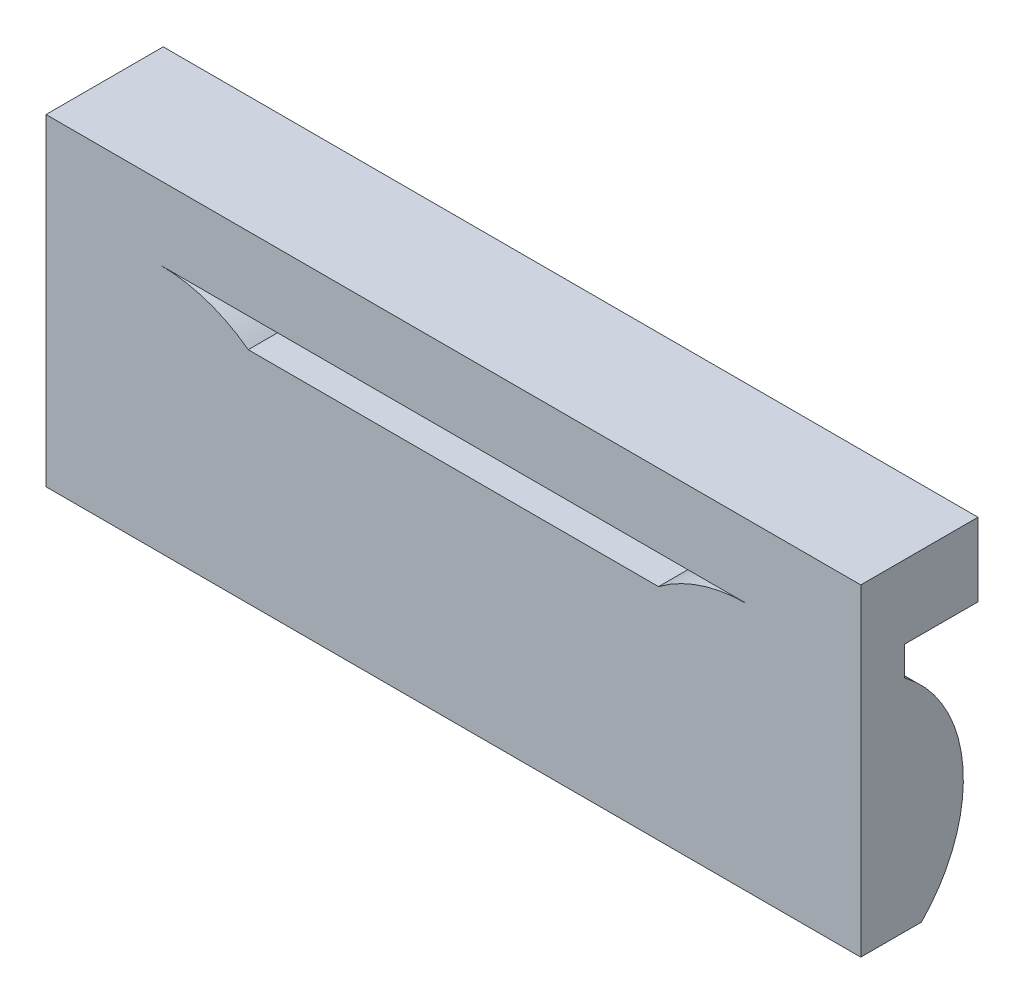
ISO-10303-21;
HEADER;
FILE_DESCRIPTION(('STEP AP214'),'2;1');
FILE_NAME('part.step','',(''),(''),'','','');
FILE_SCHEMA(('AUTOMOTIVE_DESIGN { 1 0 10303 214 1 1 1 1 }'));
ENDSEC;
DATA;
#1=APPLICATION_CONTEXT('core data for automotive mechanical design processes');
#2=APPLICATION_PROTOCOL_DEFINITION('international standard','automotive_design',2000,#1);
#3=PRODUCT_CONTEXT('',#1,'mechanical');
#4=PRODUCT('Part','Part','',(#3));
#5=PRODUCT_RELATED_PRODUCT_CATEGORY('part','',(#4));
#6=PRODUCT_DEFINITION_FORMATION('','',#4);
#7=PRODUCT_DEFINITION_CONTEXT('part definition',#1,'design');
#8=PRODUCT_DEFINITION('design','',#6,#7);
#9=PRODUCT_DEFINITION_SHAPE('','',#8);
#10=(LENGTH_UNIT() NAMED_UNIT(*) SI_UNIT(.MILLI.,.METRE.));
#11=(NAMED_UNIT(*) PLANE_ANGLE_UNIT() SI_UNIT($,.RADIAN.));
#12=(NAMED_UNIT(*) SI_UNIT($,.STERADIAN.) SOLID_ANGLE_UNIT());
#13=UNCERTAINTY_MEASURE_WITH_UNIT(LENGTH_MEASURE(1.E-05),#10,'distance_accuracy_value','');
#14=(GEOMETRIC_REPRESENTATION_CONTEXT(3) GLOBAL_UNCERTAINTY_ASSIGNED_CONTEXT((#13)) GLOBAL_UNIT_ASSIGNED_CONTEXT((#10,
#11,#12)) REPRESENTATION_CONTEXT('',''));
#15=CARTESIAN_POINT('',(0.,0.,0.));
#16=DIRECTION('',(0.,0.,1.));
#17=DIRECTION('',(1.,0.,0.));
#18=AXIS2_PLACEMENT_3D('',#15,#16,#17);
#19=CARTESIAN_POINT('',(6.5,0.,-1.625));
#20=DIRECTION('',(-1.,0.,0.));
#21=DIRECTION('',(0.,0.,1.));
#22=AXIS2_PLACEMENT_3D('',#19,#20,#21);
#23=PLANE('',#22);
#24=CARTESIAN_POINT('',(6.5,-0.999999999999999,1.125));
#25=DIRECTION('',(-1.,0.,0.));
#26=DIRECTION('',(0.,0.,1.));
#27=AXIS2_PLACEMENT_3D('',#24,#25,#26);
#28=CIRCLE('',#27,2.5);
#29=CARTESIAN_POINT('',(6.5,-2.25,-1.0400635094611));
#30=VERTEX_POINT('',#29);
#31=CARTESIAN_POINT('',(6.5,1.,-0.375));
#32=VERTEX_POINT('',#31);
#33=EDGE_CURVE('E191',#30,#32,#28,.F.);
#34=ORIENTED_EDGE('',*,*,#33,.F.);
#35=DIRECTION('',(0.,0.,1.));
#36=VECTOR('',#35,1.);
#37=CARTESIAN_POINT('',(6.5,-2.25,-1.625));
#38=LINE('',#37,#36);
#39=CARTESIAN_POINT('',(6.5,-2.25,-0.375));
#40=VERTEX_POINT('',#39);
#41=EDGE_CURVE('E341',#30,#40,#38,.T.);
#42=ORIENTED_EDGE('',*,*,#41,.T.);
#43=DIRECTION('',(0.,-1.,0.));
#44=VECTOR('',#43,1.);
#45=CARTESIAN_POINT('',(6.5,0.,-0.375));
#46=LINE('',#45,#44);
#47=EDGE_CURVE('E317',#32,#40,#46,.T.);
#48=ORIENTED_EDGE('',*,*,#47,.F.);
#49=EDGE_LOOP('',(#34,#42,#48));
#50=FACE_BOUND('',#49,.T.);
#51=ADVANCED_FACE('F43',(#50),#23,.T.);
#52=CARTESIAN_POINT('',(-6.5,0.,-1.625));
#53=DIRECTION('',(1.,0.,0.));
#54=DIRECTION('',(0.,1.,0.));
#55=AXIS2_PLACEMENT_3D('',#52,#53,#54);
#56=PLANE('',#55);
#57=CARTESIAN_POINT('',(-6.5,-0.999999999999999,1.125));
#58=DIRECTION('',(1.,0.,0.));
#59=DIRECTION('',(0.,1.,0.));
#60=AXIS2_PLACEMENT_3D('',#57,#58,#59);
#61=CIRCLE('',#60,2.5);
#62=CARTESIAN_POINT('',(-6.5,1.,-0.375));
#63=VERTEX_POINT('',#62);
#64=CARTESIAN_POINT('',(-6.5,-2.25,-1.0400635094611));
#65=VERTEX_POINT('',#64);
#66=EDGE_CURVE('E248',#63,#65,#61,.F.);
#67=ORIENTED_EDGE('',*,*,#66,.F.);
#68=DIRECTION('',(0.,1.,0.));
#69=VECTOR('',#68,1.);
#70=CARTESIAN_POINT('',(-6.5,0.,-0.375));
#71=LINE('',#70,#69);
#72=CARTESIAN_POINT('',(-6.5,-2.25,-0.375));
#73=VERTEX_POINT('',#72);
#74=EDGE_CURVE('E350',#73,#63,#71,.T.);
#75=ORIENTED_EDGE('',*,*,#74,.F.);
#76=DIRECTION('',(0.,0.,1.));
#77=VECTOR('',#76,1.);
#78=CARTESIAN_POINT('',(-6.5,-2.25,-1.625));
#79=LINE('',#78,#77);
#80=EDGE_CURVE('E67',#65,#73,#79,.T.);
#81=ORIENTED_EDGE('',*,*,#80,.F.);
#82=EDGE_LOOP('',(#67,#75,#81));
#83=FACE_BOUND('',#82,.T.);
#84=ADVANCED_FACE('F451',(#83),#56,.T.);
#85=CARTESIAN_POINT('',(0.,0.,-1.625));
#86=DIRECTION('',(0.,0.,-1.));
#87=DIRECTION('',(-1.,0.,0.));
#88=AXIS2_PLACEMENT_3D('',#85,#86,#87);
#89=PLANE('',#88);
#90=DIRECTION('',(0.,-1.,0.));
#91=VECTOR('',#90,1.);
#92=CARTESIAN_POINT('',(6.95,0.,-1.625));
#93=LINE('',#92,#91);
#94=CARTESIAN_POINT('',(6.95,2.75,-1.625));
#95=VERTEX_POINT('',#94);
#96=CARTESIAN_POINT('',(6.95,1.5,-1.625));
#97=VERTEX_POINT('',#96);
#98=EDGE_CURVE('E334',#95,#97,#93,.T.);
#99=ORIENTED_EDGE('',*,*,#98,.T.);
#100=DIRECTION('',(-1.,0.,0.));
#101=VECTOR('',#100,1.);
#102=CARTESIAN_POINT('',(0.,1.5,-1.625));
#103=LINE('',#102,#101);
#104=CARTESIAN_POINT('',(6.5,1.5,-1.625));
#105=VERTEX_POINT('',#104);
#106=EDGE_CURVE('E259',#97,#105,#103,.T.);
#107=ORIENTED_EDGE('',*,*,#106,.T.);
#108=DIRECTION('',(0.,-1.,0.));
#109=VECTOR('',#108,1.);
#110=CARTESIAN_POINT('',(6.5,0.,-1.625));
#111=LINE('',#110,#109);
#112=CARTESIAN_POINT('',(6.5,2.25,-1.625));
#113=VERTEX_POINT('',#112);
#114=EDGE_CURVE('E318',#113,#105,#111,.T.);
#115=ORIENTED_EDGE('',*,*,#114,.F.);
#116=DIRECTION('',(1.,0.,0.));
#117=VECTOR('',#116,1.);
#118=CARTESIAN_POINT('',(0.,2.25,-1.625));
#119=LINE('',#118,#117);
#120=CARTESIAN_POINT('',(-6.5,2.25,-1.625));
#121=VERTEX_POINT('',#120);
#122=EDGE_CURVE('E322',#121,#113,#119,.T.);
#123=ORIENTED_EDGE('',*,*,#122,.F.);
#124=DIRECTION('',(0.,1.,0.));
#125=VECTOR('',#124,1.);
#126=CARTESIAN_POINT('',(-6.5,0.,-1.625));
#127=LINE('',#126,#125);
#128=CARTESIAN_POINT('',(-6.5,1.5,-1.625));
#129=VERTEX_POINT('',#128);
#130=EDGE_CURVE('E327',#129,#121,#127,.T.);
#131=ORIENTED_EDGE('',*,*,#130,.F.);
#132=CARTESIAN_POINT('',(-6.95,1.5,-1.625));
#133=VERTEX_POINT('',#132);
#134=EDGE_CURVE('E254',#129,#133,#103,.T.);
#135=ORIENTED_EDGE('',*,*,#134,.T.);
#136=DIRECTION('',(0.,1.,0.));
#137=VECTOR('',#136,1.);
#138=CARTESIAN_POINT('',(-6.95,0.,-1.625));
#139=LINE('',#138,#137);
#140=CARTESIAN_POINT('',(-6.95,2.74999999999995,-1.625));
#141=VERTEX_POINT('',#140);
#142=EDGE_CURVE('E338',#133,#141,#139,.T.);
#143=ORIENTED_EDGE('',*,*,#142,.T.);
#144=DIRECTION('',(1.,0.,0.));
#145=VECTOR('',#144,1.);
#146=CARTESIAN_POINT('',(0.,2.74999999999997,-1.625));
#147=LINE('',#146,#145);
#148=EDGE_CURVE('E330',#141,#95,#147,.T.);
#149=ORIENTED_EDGE('',*,*,#148,.T.);
#150=EDGE_LOOP('',(#99,#107,#115,#123,#131,#135,#143,#149));
#151=FACE_BOUND('',#150,.T.);
#152=ADVANCED_FACE('F401',(#151),#89,.T.);
#153=CARTESIAN_POINT('',(0.,0.,0.375));
#154=DIRECTION('',(0.,0.,1.));
#155=DIRECTION('',(1.,0.,0.));
#156=AXIS2_PLACEMENT_3D('',#153,#154,#155);
#157=PLANE('',#156);
#158=DIRECTION('',(0.,1.,0.));
#159=VECTOR('',#158,1.);
#160=CARTESIAN_POINT('',(6.95,0.,0.375));
#161=LINE('',#160,#159);
#162=CARTESIAN_POINT('',(6.95,-2.75,0.375));
#163=VERTEX_POINT('',#162);
#164=CARTESIAN_POINT('',(6.95,2.75,0.375));
#165=VERTEX_POINT('',#164);
#166=EDGE_CURVE('E369',#163,#165,#161,.T.);
#167=ORIENTED_EDGE('',*,*,#166,.T.);
#168=DIRECTION('',(-1.,0.,0.));
#169=VECTOR('',#168,1.);
#170=CARTESIAN_POINT('',(0.,2.74999999999997,0.375));
#171=LINE('',#170,#169);
#172=CARTESIAN_POINT('',(-6.95,2.75,0.375));
#173=VERTEX_POINT('',#172);
#174=EDGE_CURVE('E373',#165,#173,#171,.T.);
#175=ORIENTED_EDGE('',*,*,#174,.T.);
#176=DIRECTION('',(0.,1.,0.));
#177=VECTOR('',#176,1.);
#178=CARTESIAN_POINT('',(-6.95,0.,0.375));
#179=LINE('',#178,#177);
#180=CARTESIAN_POINT('',(-6.95,-2.75,0.375));
#181=VERTEX_POINT('',#180);
#182=EDGE_CURVE('E376',#181,#173,#179,.T.);
#183=ORIENTED_EDGE('',*,*,#182,.F.);
#184=DIRECTION('',(1.,0.,0.));
#185=VECTOR('',#184,1.);
#186=CARTESIAN_POINT('',(0.,-2.75,0.375));
#187=LINE('',#186,#185);
#188=EDGE_CURVE('E380',#181,#163,#187,.T.);
#189=ORIENTED_EDGE('',*,*,#188,.T.);
#190=EDGE_LOOP('',(#167,#175,#183,#189));
#191=FACE_BOUND('',#190,.T.);
#192=DIRECTION('',(1.,0.,0.));
#193=VECTOR('',#192,1.);
#194=CARTESIAN_POINT('',(0.,1.50000000000001,0.375));
#195=LINE('',#194,#193);
#196=CARTESIAN_POINT('',(-5.,1.5,0.375));
#197=VERTEX_POINT('',#196);
#198=CARTESIAN_POINT('',(5.,1.50000000000002,0.375));
#199=VERTEX_POINT('',#198);
#200=EDGE_CURVE('E267',#197,#199,#195,.T.);
#201=ORIENTED_EDGE('',*,*,#200,.T.);
#202=CARTESIAN_POINT('',(5.00000000000001,-0.999999999999964,0.375));
#203=DIRECTION('',(0.,0.,-1.));
#204=DIRECTION('',(-1.,0.,0.));
#205=AXIS2_PLACEMENT_3D('',#202,#203,#204);
#206=CIRCLE('',#205,2.49999999999998);
#207=CARTESIAN_POINT('',(3.5,1.00000000000001,0.375));
#208=VERTEX_POINT('',#207);
#209=EDGE_CURVE('E271',#199,#208,#206,.F.);
#210=ORIENTED_EDGE('',*,*,#209,.T.);
#211=DIRECTION('',(-1.,0.,0.));
#212=VECTOR('',#211,1.);
#213=CARTESIAN_POINT('',(0.,1.00000000000001,0.375));
#214=LINE('',#213,#212);
#215=CARTESIAN_POINT('',(-3.5,1.,0.375));
#216=VERTEX_POINT('',#215);
#217=EDGE_CURVE('E59',#208,#216,#214,.T.);
#218=ORIENTED_EDGE('',*,*,#217,.T.);
#219=CARTESIAN_POINT('',(-5.,-0.999999999999999,0.375));
#220=DIRECTION('',(0.,0.,-1.));
#221=DIRECTION('',(-1.,0.,0.));
#222=AXIS2_PLACEMENT_3D('',#219,#220,#221);
#223=CIRCLE('',#222,2.5);
#224=EDGE_CURVE('E277',#216,#197,#223,.F.);
#225=ORIENTED_EDGE('',*,*,#224,.T.);
#226=EDGE_LOOP('',(#201,#210,#218,#225));
#227=FACE_BOUND('',#226,.T.);
#228=ADVANCED_FACE('F410',(#191,#227),#157,.T.);
#229=CARTESIAN_POINT('',(0.,-2.25,-1.625));
#230=DIRECTION('',(0.,1.,0.));
#231=DIRECTION('',(-1.,0.,0.));
#232=AXIS2_PLACEMENT_3D('',#229,#230,#231);
#233=PLANE('',#232);
#234=DIRECTION('',(1.,0.,0.));
#235=VECTOR('',#234,1.);
#236=CARTESIAN_POINT('',(-6.95,-2.25,-1.0400635094611));
#237=LINE('',#236,#235);
#238=CARTESIAN_POINT('',(-2.8349364905389,-2.25,-1.0400635094611));
#239=VERTEX_POINT('',#238);
#240=EDGE_CURVE('E245',#65,#239,#237,.T.);
#241=ORIENTED_EDGE('',*,*,#240,.F.);
#242=ORIENTED_EDGE('',*,*,#80,.T.);
#243=DIRECTION('',(-1.,0.,0.));
#244=VECTOR('',#243,1.);
#245=CARTESIAN_POINT('',(0.,-2.25,-0.375));
#246=LINE('',#245,#244);
#247=CARTESIAN_POINT('',(-2.8349364905389,-2.25,-0.375));
#248=VERTEX_POINT('',#247);
#249=EDGE_CURVE('E354',#248,#73,#246,.T.);
#250=ORIENTED_EDGE('',*,*,#249,.F.);
#251=DIRECTION('',(0.,0.,1.));
#252=VECTOR('',#251,1.);
#253=CARTESIAN_POINT('',(-2.8349364905389,-2.25,-2.375));
#254=LINE('',#253,#252);
#255=EDGE_CURVE('E311',#239,#248,#254,.T.);
#256=ORIENTED_EDGE('',*,*,#255,.F.);
#257=EDGE_LOOP('',(#241,#242,#250,#256));
#258=FACE_BOUND('',#257,.T.);
#259=ADVANCED_FACE('F476',(#258),#233,.T.);
#260=CARTESIAN_POINT('',(6.95,0.,0.375));
#261=DIRECTION('',(-1.,0.,0.));
#262=DIRECTION('',(0.,0.,1.));
#263=AXIS2_PLACEMENT_3D('',#260,#261,#262);
#264=PLANE('',#263);
#265=DIRECTION('',(0.,0.,-1.));
#266=VECTOR('',#265,1.);
#267=CARTESIAN_POINT('',(6.95,1.5,0.));
#268=LINE('',#267,#266);
#269=CARTESIAN_POINT('',(6.95,1.5,-0.375));
#270=VERTEX_POINT('',#269);
#271=EDGE_CURVE('E215',#270,#97,#268,.T.);
#272=ORIENTED_EDGE('',*,*,#271,.T.);
#273=ORIENTED_EDGE('',*,*,#98,.F.);
#274=DIRECTION('',(0.,0.,-1.));
#275=VECTOR('',#274,1.);
#276=CARTESIAN_POINT('',(6.95,2.75,0.375));
#277=LINE('',#276,#275);
#278=EDGE_CURVE('E52',#165,#95,#277,.T.);
#279=ORIENTED_EDGE('',*,*,#278,.F.);
#280=ORIENTED_EDGE('',*,*,#166,.F.);
#281=DIRECTION('',(0.,0.,-1.));
#282=VECTOR('',#281,1.);
#283=CARTESIAN_POINT('',(6.95,-2.75,0.375));
#284=LINE('',#283,#282);
#285=CARTESIAN_POINT('',(6.95,-2.75,-0.66035710713571));
#286=VERTEX_POINT('',#285);
#287=EDGE_CURVE('E213',#163,#286,#284,.T.);
#288=ORIENTED_EDGE('',*,*,#287,.T.);
#289=CARTESIAN_POINT('',(6.95,-0.999999999999999,1.125));
#290=DIRECTION('',(1.,0.,0.));
#291=DIRECTION('',(0.,0.,-1.));
#292=AXIS2_PLACEMENT_3D('',#289,#290,#291);
#293=CIRCLE('',#292,2.5);
#294=CARTESIAN_POINT('',(6.95,1.,-0.375));
#295=VERTEX_POINT('',#294);
#296=EDGE_CURVE('E188',#295,#286,#293,.F.);
#297=ORIENTED_EDGE('',*,*,#296,.F.);
#298=DIRECTION('',(0.,1.,0.));
#299=VECTOR('',#298,1.);
#300=CARTESIAN_POINT('',(6.95,0.,-0.375000000000001));
#301=LINE('',#300,#299);
#302=EDGE_CURVE('E200',#295,#270,#301,.T.);
#303=ORIENTED_EDGE('',*,*,#302,.T.);
#304=EDGE_LOOP('',(#272,#273,#279,#280,#288,#297,#303));
#305=FACE_BOUND('',#304,.T.);
#306=ADVANCED_FACE('F45',(#305),#264,.F.);
#307=CARTESIAN_POINT('',(0.,2.74999999999997,0.375));
#308=DIRECTION('',(0.,-1.,0.));
#309=DIRECTION('',(1.,0.,0.));
#310=AXIS2_PLACEMENT_3D('',#307,#308,#309);
#311=PLANE('',#310);
#312=ORIENTED_EDGE('',*,*,#278,.T.);
#313=ORIENTED_EDGE('',*,*,#148,.F.);
#314=DIRECTION('',(0.,0.,-1.));
#315=VECTOR('',#314,1.);
#316=CARTESIAN_POINT('',(-6.95,2.75,0.375));
#317=LINE('',#316,#315);
#318=EDGE_CURVE('E389',#173,#141,#317,.T.);
#319=ORIENTED_EDGE('',*,*,#318,.F.);
#320=ORIENTED_EDGE('',*,*,#174,.F.);
#321=EDGE_LOOP('',(#312,#313,#319,#320));
#322=FACE_BOUND('',#321,.T.);
#323=ADVANCED_FACE('F397',(#322),#311,.F.);
#324=CARTESIAN_POINT('',(-6.95,0.,0.375));
#325=DIRECTION('',(-1.,0.,0.));
#326=DIRECTION('',(0.,0.,1.));
#327=AXIS2_PLACEMENT_3D('',#324,#325,#326);
#328=PLANE('',#327);
#329=ORIENTED_EDGE('',*,*,#142,.F.);
#330=DIRECTION('',(0.,0.,-1.));
#331=VECTOR('',#330,1.);
#332=CARTESIAN_POINT('',(-6.95,1.5,0.));
#333=LINE('',#332,#331);
#334=CARTESIAN_POINT('',(-6.95,1.5,-0.375));
#335=VERTEX_POINT('',#334);
#336=EDGE_CURVE('E197',#335,#133,#333,.T.);
#337=ORIENTED_EDGE('',*,*,#336,.F.);
#338=DIRECTION('',(0.,1.,0.));
#339=VECTOR('',#338,1.);
#340=CARTESIAN_POINT('',(-6.95,0.,-0.375000000000001));
#341=LINE('',#340,#339);
#342=CARTESIAN_POINT('',(-6.95,1.,-0.375));
#343=VERTEX_POINT('',#342);
#344=EDGE_CURVE('E218',#343,#335,#341,.T.);
#345=ORIENTED_EDGE('',*,*,#344,.F.);
#346=CARTESIAN_POINT('',(-6.95,-0.999999999999999,1.125));
#347=DIRECTION('',(1.,0.,0.));
#348=DIRECTION('',(0.,0.,-1.));
#349=AXIS2_PLACEMENT_3D('',#346,#347,#348);
#350=CIRCLE('',#349,2.5);
#351=CARTESIAN_POINT('',(-6.95,-2.75,-0.66035710713571));
#352=VERTEX_POINT('',#351);
#353=EDGE_CURVE('E223',#343,#352,#350,.F.);
#354=ORIENTED_EDGE('',*,*,#353,.T.);
#355=DIRECTION('',(0.,0.,-1.));
#356=VECTOR('',#355,1.);
#357=CARTESIAN_POINT('',(-6.95,-2.75,0.375));
#358=LINE('',#357,#356);
#359=EDGE_CURVE('E385',#181,#352,#358,.T.);
#360=ORIENTED_EDGE('',*,*,#359,.F.);
#361=ORIENTED_EDGE('',*,*,#182,.T.);
#362=ORIENTED_EDGE('',*,*,#318,.T.);
#363=EDGE_LOOP('',(#329,#337,#345,#354,#360,#361,#362));
#364=FACE_BOUND('',#363,.T.);
#365=ADVANCED_FACE('F406',(#364),#328,.T.);
#366=CARTESIAN_POINT('',(0.,-2.75,0.375));
#367=DIRECTION('',(0.,1.,0.));
#368=DIRECTION('',(0.,0.,1.));
#369=AXIS2_PLACEMENT_3D('',#366,#367,#368);
#370=PLANE('',#369);
#371=ORIENTED_EDGE('',*,*,#359,.T.);
#372=DIRECTION('',(1.,0.,0.));
#373=VECTOR('',#372,1.);
#374=CARTESIAN_POINT('',(-6.95,-2.75,-0.66035710713571));
#375=LINE('',#374,#373);
#376=EDGE_CURVE('E251',#352,#286,#375,.T.);
#377=ORIENTED_EDGE('',*,*,#376,.T.);
#378=ORIENTED_EDGE('',*,*,#287,.F.);
#379=ORIENTED_EDGE('',*,*,#188,.F.);
#380=EDGE_LOOP('',(#371,#377,#378,#379));
#381=FACE_BOUND('',#380,.T.);
#382=ADVANCED_FACE('F413',(#381),#370,.F.);
#383=ORIENTED_EDGE('',*,*,#114,.T.);
#384=DIRECTION('',(0.,0.,1.));
#385=VECTOR('',#384,1.);
#386=CARTESIAN_POINT('',(6.5,1.5,-1.625));
#387=LINE('',#386,#385);
#388=CARTESIAN_POINT('',(6.5,1.5,-0.375));
#389=VERTEX_POINT('',#388);
#390=EDGE_CURVE('E263',#105,#389,#387,.T.);
#391=ORIENTED_EDGE('',*,*,#390,.T.);
#392=CARTESIAN_POINT('',(6.5,2.25,-0.375));
#393=VERTEX_POINT('',#392);
#394=EDGE_CURVE('E342',#393,#389,#46,.T.);
#395=ORIENTED_EDGE('',*,*,#394,.F.);
#396=DIRECTION('',(0.,0.,1.));
#397=VECTOR('',#396,1.);
#398=CARTESIAN_POINT('',(6.5,2.25,-1.625));
#399=LINE('',#398,#397);
#400=EDGE_CURVE('E366',#113,#393,#399,.T.);
#401=ORIENTED_EDGE('',*,*,#400,.F.);
#402=EDGE_LOOP('',(#383,#391,#395,#401));
#403=FACE_BOUND('',#402,.T.);
#404=ADVANCED_FACE('F437',(#403),#23,.T.);
#405=CARTESIAN_POINT('',(0.,2.25,-1.625));
#406=DIRECTION('',(0.,-1.,0.));
#407=DIRECTION('',(1.,0.,0.));
#408=AXIS2_PLACEMENT_3D('',#405,#406,#407);
#409=PLANE('',#408);
#410=DIRECTION('',(1.,0.,0.));
#411=VECTOR('',#410,1.);
#412=CARTESIAN_POINT('',(0.,2.25,-0.375));
#413=LINE('',#412,#411);
#414=CARTESIAN_POINT('',(-6.5,2.25,-0.375));
#415=VERTEX_POINT('',#414);
#416=EDGE_CURVE('E345',#415,#393,#413,.T.);
#417=ORIENTED_EDGE('',*,*,#416,.F.);
#418=DIRECTION('',(0.,0.,1.));
#419=VECTOR('',#418,1.);
#420=CARTESIAN_POINT('',(-6.5,2.25,-1.625));
#421=LINE('',#420,#419);
#422=EDGE_CURVE('E362',#121,#415,#421,.T.);
#423=ORIENTED_EDGE('',*,*,#422,.F.);
#424=ORIENTED_EDGE('',*,*,#122,.T.);
#425=ORIENTED_EDGE('',*,*,#400,.T.);
#426=EDGE_LOOP('',(#417,#423,#424,#425));
#427=FACE_BOUND('',#426,.T.);
#428=ADVANCED_FACE('F426',(#427),#409,.T.);
#429=CARTESIAN_POINT('',(-6.5,1.5,-0.375));
#430=VERTEX_POINT('',#429);
#431=EDGE_CURVE('E349',#430,#415,#71,.T.);
#432=ORIENTED_EDGE('',*,*,#431,.F.);
#433=DIRECTION('',(0.,0.,-1.));
#434=VECTOR('',#433,1.);
#435=CARTESIAN_POINT('',(-6.5,1.5,-1.625));
#436=LINE('',#435,#434);
#437=EDGE_CURVE('E258',#430,#129,#436,.T.);
#438=ORIENTED_EDGE('',*,*,#437,.T.);
#439=ORIENTED_EDGE('',*,*,#130,.T.);
#440=ORIENTED_EDGE('',*,*,#422,.T.);
#441=EDGE_LOOP('',(#432,#438,#439,#440));
#442=FACE_BOUND('',#441,.T.);
#443=ADVANCED_FACE('F420',(#442),#56,.T.);
#444=DIRECTION('',(1.,0.,0.));
#445=VECTOR('',#444,1.);
#446=CARTESIAN_POINT('',(-6.95,-2.25,-1.0400635094611));
#447=LINE('',#446,#445);
#448=CARTESIAN_POINT('',(2.83493649053895,-2.25,-1.04006350946106));
#449=VERTEX_POINT('',#448);
#450=EDGE_CURVE('E237',#449,#30,#447,.T.);
#451=ORIENTED_EDGE('',*,*,#450,.F.);
#452=DIRECTION('',(0.,0.,1.));
#453=VECTOR('',#452,1.);
#454=CARTESIAN_POINT('',(2.83493649053895,-2.25,-2.375));
#455=LINE('',#454,#453);
#456=CARTESIAN_POINT('',(2.83493649053895,-2.25,-0.375));
#457=VERTEX_POINT('',#456);
#458=EDGE_CURVE('E314',#449,#457,#455,.T.);
#459=ORIENTED_EDGE('',*,*,#458,.T.);
#460=EDGE_CURVE('E323',#40,#457,#246,.T.);
#461=ORIENTED_EDGE('',*,*,#460,.F.);
#462=ORIENTED_EDGE('',*,*,#41,.F.);
#463=EDGE_LOOP('',(#451,#459,#461,#462));
#464=FACE_BOUND('',#463,.T.);
#465=ADVANCED_FACE('F481',(#464),#233,.T.);
#466=CARTESIAN_POINT('',(0.,0.,-0.375));
#467=DIRECTION('',(0.,0.,1.));
#468=DIRECTION('',(1.,0.,0.));
#469=AXIS2_PLACEMENT_3D('',#466,#467,#468);
#470=PLANE('',#469);
#471=CARTESIAN_POINT('',(5.00000000000001,-0.999999999999964,-0.375));
#472=DIRECTION('',(0.,0.,-1.));
#473=DIRECTION('',(-1.,0.,0.));
#474=AXIS2_PLACEMENT_3D('',#471,#472,#473);
#475=CIRCLE('',#474,2.49999999999998);
#476=CARTESIAN_POINT('',(3.5,1.,-0.375));
#477=VERTEX_POINT('',#476);
#478=EDGE_CURVE('E308',#457,#477,#475,.T.);
#479=ORIENTED_EDGE('',*,*,#478,.T.);
#480=CARTESIAN_POINT('',(5.00000000000001,-0.999999999999964,-0.375));
#481=DIRECTION('',(0.,0.,1.));
#482=DIRECTION('',(1.,0.,0.));
#483=AXIS2_PLACEMENT_3D('',#480,#481,#482);
#484=CIRCLE('',#483,2.49999999999998);
#485=CARTESIAN_POINT('',(5.,1.50000000000002,-0.375));
#486=VERTEX_POINT('',#485);
#487=EDGE_CURVE('E286',#477,#486,#484,.F.);
#488=ORIENTED_EDGE('',*,*,#487,.T.);
#489=DIRECTION('',(1.,0.,0.));
#490=VECTOR('',#489,1.);
#491=CARTESIAN_POINT('',(0.,1.50000000000001,-0.375));
#492=LINE('',#491,#490);
#493=CARTESIAN_POINT('',(-5.,1.5,-0.375));
#494=VERTEX_POINT('',#493);
#495=EDGE_CURVE('E305',#494,#486,#492,.T.);
#496=ORIENTED_EDGE('',*,*,#495,.F.);
#497=CARTESIAN_POINT('',(-5.,-0.999999999999999,-0.375));
#498=DIRECTION('',(0.,0.,-1.));
#499=DIRECTION('',(-1.,0.,0.));
#500=AXIS2_PLACEMENT_3D('',#497,#498,#499);
#501=CIRCLE('',#500,2.5);
#502=CARTESIAN_POINT('',(-3.5,1.,-0.375));
#503=VERTEX_POINT('',#502);
#504=EDGE_CURVE('E301',#494,#503,#501,.T.);
#505=ORIENTED_EDGE('',*,*,#504,.T.);
#506=EDGE_CURVE('E300',#503,#248,#501,.T.);
#507=ORIENTED_EDGE('',*,*,#506,.T.);
#508=ORIENTED_EDGE('',*,*,#249,.T.);
#509=ORIENTED_EDGE('',*,*,#74,.T.);
#510=DIRECTION('',(1.,0.,0.));
#511=VECTOR('',#510,1.);
#512=CARTESIAN_POINT('',(-6.95,1.,-0.375));
#513=LINE('',#512,#511);
#514=EDGE_CURVE('E196',#343,#63,#513,.T.);
#515=ORIENTED_EDGE('',*,*,#514,.F.);
#516=ORIENTED_EDGE('',*,*,#344,.T.);
#517=DIRECTION('',(1.,0.,0.));
#518=VECTOR('',#517,1.);
#519=CARTESIAN_POINT('',(-6.95,1.5,-0.375));
#520=LINE('',#519,#518);
#521=EDGE_CURVE('E229',#335,#430,#520,.T.);
#522=ORIENTED_EDGE('',*,*,#521,.T.);
#523=ORIENTED_EDGE('',*,*,#431,.T.);
#524=ORIENTED_EDGE('',*,*,#416,.T.);
#525=ORIENTED_EDGE('',*,*,#394,.T.);
#526=EDGE_CURVE('E204',#389,#270,#520,.T.);
#527=ORIENTED_EDGE('',*,*,#526,.T.);
#528=ORIENTED_EDGE('',*,*,#302,.F.);
#529=EDGE_CURVE('E183',#32,#295,#513,.T.);
#530=ORIENTED_EDGE('',*,*,#529,.F.);
#531=ORIENTED_EDGE('',*,*,#47,.T.);
#532=ORIENTED_EDGE('',*,*,#460,.T.);
#533=EDGE_LOOP('',(#479,#488,#496,#505,#507,#508,#509,#515,#516,#522,#523,#524,#525,#527,#528,
#530,#531,#532));
#534=FACE_BOUND('',#533,.T.);
#535=ADVANCED_FACE('F202',(#534),#470,.F.);
#536=CARTESIAN_POINT('',(-5.,-0.999999999999999,-2.375));
#537=DIRECTION('',(0.,0.,1.));
#538=DIRECTION('',(1.,0.,0.));
#539=AXIS2_PLACEMENT_3D('',#536,#537,#538);
#540=CYLINDRICAL_SURFACE('',#539,2.5);
#541=CARTESIAN_POINT('',(-5.,-0.999999999999999,1.125));
#542=DIRECTION('',(0.707106781186547,0.,0.707106781186547));
#543=DIRECTION('',(-0.707106781186547,0.,0.707106781186547));
#544=AXIS2_PLACEMENT_3D('',#541,#542,#543);
#545=ELLIPSE('',#544,3.53553390593274,2.5);
#546=EDGE_CURVE('E242',#239,#503,#545,.T.);
#547=ORIENTED_EDGE('',*,*,#546,.F.);
#548=ORIENTED_EDGE('',*,*,#255,.T.);
#549=ORIENTED_EDGE('',*,*,#506,.F.);
#550=EDGE_LOOP('',(#547,#548,#549));
#551=FACE_BOUND('',#550,.T.);
#552=ADVANCED_FACE('F492',(#551),#540,.F.);
#553=CARTESIAN_POINT('',(5.00000000000001,-0.999999999999964,-2.375));
#554=DIRECTION('',(0.,0.,1.));
#555=DIRECTION('',(1.,0.,0.));
#556=AXIS2_PLACEMENT_3D('',#553,#554,#555);
#557=CYLINDRICAL_SURFACE('',#556,2.49999999999998);
#558=CARTESIAN_POINT('',(5.00000000000001,-0.999999999999982,1.125));
#559=DIRECTION('',(-0.707106781186547,0.,0.707106781186547));
#560=DIRECTION('',(0.707106781186547,0.,0.707106781186547));
#561=AXIS2_PLACEMENT_3D('',#558,#559,#560);
#562=ELLIPSE('',#561,3.53553390593273,2.49999999999999);
#563=EDGE_CURVE('E232',#477,#449,#562,.T.);
#564=ORIENTED_EDGE('',*,*,#563,.F.);
#565=ORIENTED_EDGE('',*,*,#478,.F.);
#566=ORIENTED_EDGE('',*,*,#458,.F.);
#567=EDGE_LOOP('',(#564,#565,#566));
#568=FACE_BOUND('',#567,.T.);
#569=ADVANCED_FACE('F500',(#568),#557,.F.);
#570=CARTESIAN_POINT('',(0.,1.50000000000001,0.375));
#571=DIRECTION('',(0.,1.,0.));
#572=DIRECTION('',(-1.,0.,0.));
#573=AXIS2_PLACEMENT_3D('',#570,#571,#572);
#574=PLANE('',#573);
#575=DIRECTION('',(0.,0.,-1.));
#576=VECTOR('',#575,1.);
#577=CARTESIAN_POINT('',(5.,1.50000000000002,0.375));
#578=LINE('',#577,#576);
#579=EDGE_CURVE('E281',#199,#486,#578,.T.);
#580=ORIENTED_EDGE('',*,*,#579,.F.);
#581=ORIENTED_EDGE('',*,*,#200,.F.);
#582=DIRECTION('',(0.,0.,-1.));
#583=VECTOR('',#582,1.);
#584=CARTESIAN_POINT('',(-5.,1.5,0.375));
#585=LINE('',#584,#583);
#586=EDGE_CURVE('E282',#197,#494,#585,.T.);
#587=ORIENTED_EDGE('',*,*,#586,.T.);
#588=ORIENTED_EDGE('',*,*,#495,.T.);
#589=EDGE_LOOP('',(#580,#581,#587,#588));
#590=FACE_BOUND('',#589,.T.);
#591=ADVANCED_FACE('F519',(#590),#574,.F.);
#592=CARTESIAN_POINT('',(-5.,-0.999999999999999,0.375));
#593=DIRECTION('',(0.,0.,-1.));
#594=DIRECTION('',(-1.,0.,0.));
#595=AXIS2_PLACEMENT_3D('',#592,#593,#594);
#596=CYLINDRICAL_SURFACE('',#595,2.5);
#597=ORIENTED_EDGE('',*,*,#586,.F.);
#598=ORIENTED_EDGE('',*,*,#224,.F.);
#599=DIRECTION('',(0.,0.,-1.));
#600=VECTOR('',#599,1.);
#601=CARTESIAN_POINT('',(-3.5,1.,0.375));
#602=LINE('',#601,#600);
#603=EDGE_CURVE('E287',#216,#503,#602,.T.);
#604=ORIENTED_EDGE('',*,*,#603,.T.);
#605=ORIENTED_EDGE('',*,*,#504,.F.);
#606=EDGE_LOOP('',(#597,#598,#604,#605));
#607=FACE_BOUND('',#606,.T.);
#608=ADVANCED_FACE('F508',(#607),#596,.T.);
#609=CARTESIAN_POINT('',(5.00000000000001,-0.999999999999964,0.375));
#610=DIRECTION('',(0.,0.,-1.));
#611=DIRECTION('',(-1.,0.,0.));
#612=AXIS2_PLACEMENT_3D('',#609,#610,#611);
#613=CYLINDRICAL_SURFACE('',#612,2.49999999999998);
#614=DIRECTION('',(0.,0.,-1.));
#615=VECTOR('',#614,1.);
#616=CARTESIAN_POINT('',(3.5,1.00000000000001,0.375));
#617=LINE('',#616,#615);
#618=EDGE_CURVE('E291',#208,#477,#617,.T.);
#619=ORIENTED_EDGE('',*,*,#618,.F.);
#620=ORIENTED_EDGE('',*,*,#209,.F.);
#621=ORIENTED_EDGE('',*,*,#579,.T.);
#622=ORIENTED_EDGE('',*,*,#487,.F.);
#623=EDGE_LOOP('',(#619,#620,#621,#622));
#624=FACE_BOUND('',#623,.T.);
#625=ADVANCED_FACE('F447',(#624),#613,.T.);
#626=CARTESIAN_POINT('',(0.,1.00000000000001,0.375));
#627=DIRECTION('',(0.,-1.,0.));
#628=DIRECTION('',(1.,0.,0.));
#629=AXIS2_PLACEMENT_3D('',#626,#627,#628);
#630=PLANE('',#629);
#631=ORIENTED_EDGE('',*,*,#618,.T.);
#632=DIRECTION('',(1.,0.,0.));
#633=VECTOR('',#632,1.);
#634=CARTESIAN_POINT('',(-6.95,0.999999999999996,-0.375000000000008));
#635=LINE('',#634,#633);
#636=EDGE_CURVE('E11',#477,#503,#635,.F.);
#637=ORIENTED_EDGE('',*,*,#636,.T.);
#638=ORIENTED_EDGE('',*,*,#603,.F.);
#639=ORIENTED_EDGE('',*,*,#217,.F.);
#640=EDGE_LOOP('',(#631,#637,#638,#639));
#641=FACE_BOUND('',#640,.T.);
#642=ADVANCED_FACE('F440',(#641),#630,.F.);
#643=CARTESIAN_POINT('',(-6.95,1.5,0.));
#644=DIRECTION('',(0.,-1.,0.));
#645=DIRECTION('',(0.,0.,-1.));
#646=AXIS2_PLACEMENT_3D('',#643,#644,#645);
#647=PLANE('',#646);
#648=ORIENTED_EDGE('',*,*,#106,.F.);
#649=ORIENTED_EDGE('',*,*,#271,.F.);
#650=ORIENTED_EDGE('',*,*,#526,.F.);
#651=ORIENTED_EDGE('',*,*,#390,.F.);
#652=EDGE_LOOP('',(#648,#649,#650,#651));
#653=FACE_BOUND('',#652,.T.);
#654=ADVANCED_FACE('F438',(#653),#647,.T.);
#655=CARTESIAN_POINT('',(-6.95,-0.999999999999999,1.125));
#656=DIRECTION('',(1.,0.,0.));
#657=DIRECTION('',(0.,0.,-1.));
#658=AXIS2_PLACEMENT_3D('',#655,#656,#657);
#659=CYLINDRICAL_SURFACE('',#658,2.5);
#660=ORIENTED_EDGE('',*,*,#353,.F.);
#661=ORIENTED_EDGE('',*,*,#514,.T.);
#662=ORIENTED_EDGE('',*,*,#66,.T.);
#663=ORIENTED_EDGE('',*,*,#240,.T.);
#664=ORIENTED_EDGE('',*,*,#546,.T.);
#665=ORIENTED_EDGE('',*,*,#636,.F.);
#666=ORIENTED_EDGE('',*,*,#563,.T.);
#667=ORIENTED_EDGE('',*,*,#450,.T.);
#668=ORIENTED_EDGE('',*,*,#33,.T.);
#669=ORIENTED_EDGE('',*,*,#529,.T.);
#670=ORIENTED_EDGE('',*,*,#296,.T.);
#671=ORIENTED_EDGE('',*,*,#376,.F.);
#672=EDGE_LOOP('',(#660,#661,#662,#663,#664,#665,#666,#667,#668,#669,#670,#671));
#673=FACE_BOUND('',#672,.T.);
#674=ADVANCED_FACE('F186',(#673),#659,.T.);
#675=ORIENTED_EDGE('',*,*,#521,.F.);
#676=ORIENTED_EDGE('',*,*,#336,.T.);
#677=ORIENTED_EDGE('',*,*,#134,.F.);
#678=ORIENTED_EDGE('',*,*,#437,.F.);
#679=EDGE_LOOP('',(#675,#676,#677,#678));
#680=FACE_BOUND('',#679,.T.);
#681=ADVANCED_FACE('F418',(#680),#647,.T.);
#682=CLOSED_SHELL('',(#51,#84,#152,#228,#259,#306,#323,#365,#382,#404,#428,#443,#465,#535,#552,
#569,#591,#608,#625,#642,#654,#674,#681));
#683=MANIFOLD_SOLID_BREP('B2',#682);
#684=ADVANCED_BREP_SHAPE_REPRESENTATION('',(#18,#683),#14);
#685=SHAPE_DEFINITION_REPRESENTATION(#9,#684);
ENDSEC;
END-ISO-10303-21;
